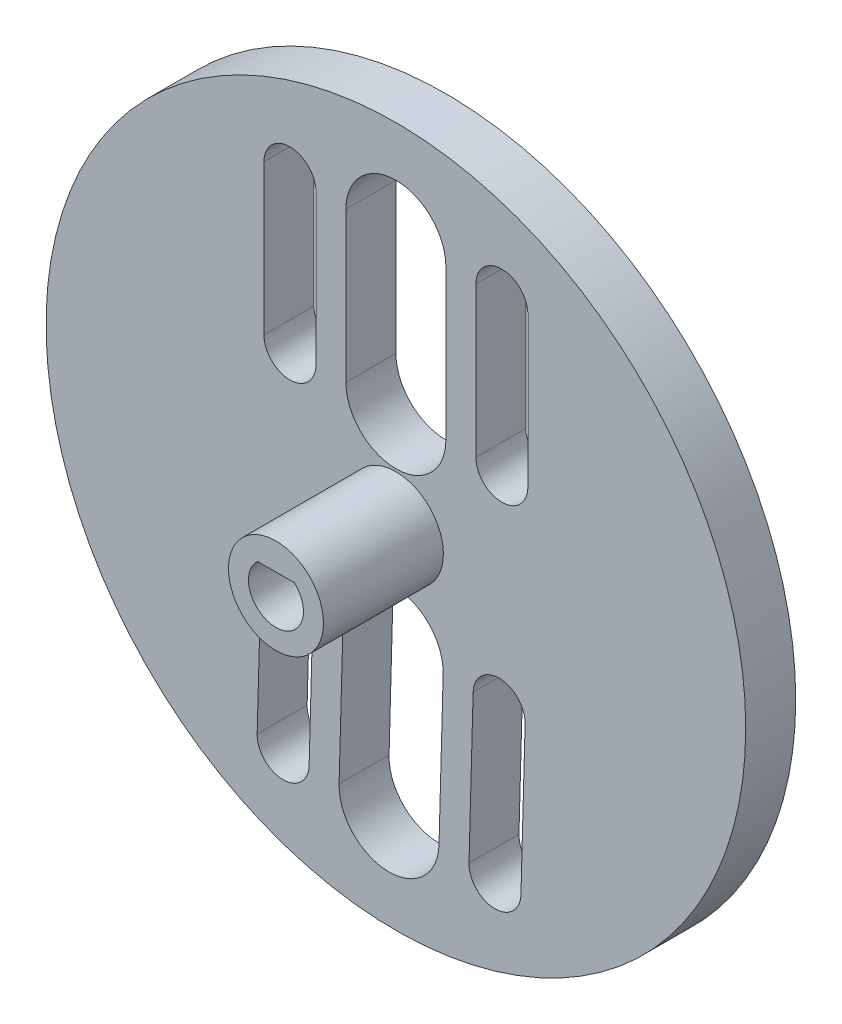
ISO-10303-21;
HEADER;
FILE_DESCRIPTION(('STEP AP214'),'2;1');
FILE_NAME('part.step','',(''),(''),'','','');
FILE_SCHEMA(('AUTOMOTIVE_DESIGN { 1 0 10303 214 1 1 1 1 }'));
ENDSEC;
DATA;
#1=APPLICATION_CONTEXT('core data for automotive mechanical design processes');
#2=APPLICATION_PROTOCOL_DEFINITION('international standard','automotive_design',2000,#1);
#3=PRODUCT_CONTEXT('',#1,'mechanical');
#4=PRODUCT('Part','Part','',(#3));
#5=PRODUCT_RELATED_PRODUCT_CATEGORY('part','',(#4));
#6=PRODUCT_DEFINITION_FORMATION('','',#4);
#7=PRODUCT_DEFINITION_CONTEXT('part definition',#1,'design');
#8=PRODUCT_DEFINITION('design','',#6,#7);
#9=PRODUCT_DEFINITION_SHAPE('','',#8);
#10=(LENGTH_UNIT() NAMED_UNIT(*) SI_UNIT(.MILLI.,.METRE.));
#11=(NAMED_UNIT(*) PLANE_ANGLE_UNIT() SI_UNIT($,.RADIAN.));
#12=(NAMED_UNIT(*) SI_UNIT($,.STERADIAN.) SOLID_ANGLE_UNIT());
#13=UNCERTAINTY_MEASURE_WITH_UNIT(LENGTH_MEASURE(1.E-05),#10,'distance_accuracy_value','');
#14=(GEOMETRIC_REPRESENTATION_CONTEXT(3) GLOBAL_UNCERTAINTY_ASSIGNED_CONTEXT((#13)) GLOBAL_UNIT_ASSIGNED_CONTEXT((#10,
#11,#12)) REPRESENTATION_CONTEXT('',''));
#15=CARTESIAN_POINT('',(0.,0.,0.));
#16=DIRECTION('',(0.,0.,1.));
#17=DIRECTION('',(1.,0.,0.));
#18=AXIS2_PLACEMENT_3D('',#15,#16,#17);
#19=CARTESIAN_POINT('',(0.,0.,5.));
#20=DIRECTION('',(0.,0.,1.));
#21=DIRECTION('',(1.,0.,0.));
#22=AXIS2_PLACEMENT_3D('',#19,#20,#21);
#23=PLANE('',#22);
#24=CARTESIAN_POINT('',(0.,0.,5.));
#25=DIRECTION('',(0.,0.,1.));
#26=DIRECTION('',(1.,0.,0.));
#27=AXIS2_PLACEMENT_3D('',#24,#25,#26);
#28=CIRCLE('',#27,4.75);
#29=CARTESIAN_POINT('',(4.75,0.,5.));
#30=VERTEX_POINT('',#29);
#31=EDGE_CURVE('E475',#30,#30,#28,.T.);
#32=ORIENTED_EDGE('',*,*,#31,.F.);
#33=EDGE_LOOP('',(#32));
#34=FACE_BOUND('',#33,.T.);
#35=CARTESIAN_POINT('',(-10.8678563010793,-9.99044167422661,5.));
#36=DIRECTION('',(0.,0.,1.));
#37=DIRECTION('',(1.,0.,0.));
#38=AXIS2_PLACEMENT_3D('',#35,#36,#37);
#39=CIRCLE('',#38,2.59999999999999);
#40=CARTESIAN_POINT('',(-8.2688454844185,-10.0621548172361,5.));
#41=VERTEX_POINT('',#40);
#42=CARTESIAN_POINT('',(-13.46686711774,-9.9187285312171,5.));
#43=VERTEX_POINT('',#42);
#44=EDGE_CURVE('E362',#41,#43,#39,.T.);
#45=ORIENTED_EDGE('',*,*,#44,.F.);
#46=DIRECTION('',(0.0275819780805787,0.999619544869528,0.));
#47=VECTOR('',#46,1.);
#48=CARTESIAN_POINT('',(-7.98512628759905,0.220329403687236,5.));
#49=LINE('',#48,#47);
#50=CARTESIAN_POINT('',(-8.68257515562718,-25.056447990279,5.));
#51=VERTEX_POINT('',#50);
#52=EDGE_CURVE('E287',#51,#41,#49,.T.);
#53=ORIENTED_EDGE('',*,*,#52,.F.);
#54=CARTESIAN_POINT('',(-11.2815859722879,-24.9847348472695,5.));
#55=DIRECTION('',(0.,0.,1.));
#56=DIRECTION('',(1.,0.,0.));
#57=AXIS2_PLACEMENT_3D('',#54,#55,#56);
#58=CIRCLE('',#57,2.59999999999999);
#59=CARTESIAN_POINT('',(-13.8805967889487,-24.91302170426,5.));
#60=VERTEX_POINT('',#59);
#61=EDGE_CURVE('E365',#60,#51,#58,.T.);
#62=ORIENTED_EDGE('',*,*,#61,.F.);
#63=DIRECTION('',(0.0275819780805777,0.999619544869528,0.));
#64=VECTOR('',#63,1.);
#65=CARTESIAN_POINT('',(-13.1831479209206,0.363755689706232,5.));
#66=LINE('',#65,#64);
#67=EDGE_CURVE('E371',#60,#43,#66,.T.);
#68=ORIENTED_EDGE('',*,*,#67,.T.);
#69=EDGE_LOOP('',(#45,#53,#62,#68));
#70=FACE_BOUND('',#69,.T.);
#71=CARTESIAN_POINT('',(-0.685618796670931,-25.2771038149237,5.));
#72=DIRECTION('',(0.,0.,1.));
#73=DIRECTION('',(1.,0.,0.));
#74=AXIS2_PLACEMENT_3D('',#71,#72,#73);
#75=CIRCLE('',#74,5.);
#76=CARTESIAN_POINT('',(-5.68371652101857,-25.1391939245208,5.));
#77=VERTEX_POINT('',#76);
#78=CARTESIAN_POINT('',(4.31247892767671,-25.4150137053265,5.));
#79=VERTEX_POINT('',#78);
#80=EDGE_CURVE('E373',#77,#79,#75,.T.);
#81=ORIENTED_EDGE('',*,*,#80,.F.);
#82=DIRECTION('',(-0.0275819780805781,-0.999619544869528,0.));
#83=VECTOR('',#82,1.);
#84=CARTESIAN_POINT('',(-4.98626765299046,0.137583469445497,5.));
#85=LINE('',#84,#83);
#86=CARTESIAN_POINT('',(-5.2699868498099,-10.1449007514778,5.));
#87=VERTEX_POINT('',#86);
#88=EDGE_CURVE('E376',#87,#77,#85,.T.);
#89=ORIENTED_EDGE('',*,*,#88,.F.);
#90=CARTESIAN_POINT('',(-0.27188912546226,-10.2828106418807,5.));
#91=DIRECTION('',(0.,0.,1.));
#92=DIRECTION('',(1.,0.,0.));
#93=AXIS2_PLACEMENT_3D('',#90,#91,#92);
#94=CIRCLE('',#93,5.);
#95=CARTESIAN_POINT('',(4.72620859888538,-10.4207205322836,5.));
#96=VERTEX_POINT('',#95);
#97=EDGE_CURVE('E379',#96,#87,#94,.T.);
#98=ORIENTED_EDGE('',*,*,#97,.F.);
#99=DIRECTION('',(-0.0275819780805781,-0.999619544869528,0.));
#100=VECTOR('',#99,1.);
#101=CARTESIAN_POINT('',(5.00992779570482,-0.138236311360284,5.));
#102=LINE('',#101,#100);
#103=EDGE_CURVE('E382',#96,#79,#102,.T.);
#104=ORIENTED_EDGE('',*,*,#103,.T.);
#105=EDGE_LOOP('',(#81,#89,#98,#104));
#106=FACE_BOUND('',#105,.T.);
#107=CARTESIAN_POINT('',(10.6,10.,5.));
#108=DIRECTION('',(0.,0.,1.));
#109=DIRECTION('',(1.,0.,0.));
#110=AXIS2_PLACEMENT_3D('',#107,#108,#109);
#111=CIRCLE('',#110,2.6);
#112=CARTESIAN_POINT('',(8.,10.,5.));
#113=VERTEX_POINT('',#112);
#114=CARTESIAN_POINT('',(13.2,10.,5.));
#115=VERTEX_POINT('',#114);
#116=EDGE_CURVE('E384',#113,#115,#111,.T.);
#117=ORIENTED_EDGE('',*,*,#116,.F.);
#118=DIRECTION('',(0.,-1.,0.));
#119=VECTOR('',#118,1.);
#120=CARTESIAN_POINT('',(8.00000000000001,0.,5.));
#121=LINE('',#120,#119);
#122=CARTESIAN_POINT('',(8.,25.,5.));
#123=VERTEX_POINT('',#122);
#124=EDGE_CURVE('E387',#123,#113,#121,.T.);
#125=ORIENTED_EDGE('',*,*,#124,.F.);
#126=CARTESIAN_POINT('',(10.6,25.,5.));
#127=DIRECTION('',(0.,0.,1.));
#128=DIRECTION('',(1.,0.,0.));
#129=AXIS2_PLACEMENT_3D('',#126,#127,#128);
#130=CIRCLE('',#129,2.6);
#131=CARTESIAN_POINT('',(13.2,25.,5.));
#132=VERTEX_POINT('',#131);
#133=EDGE_CURVE('E390',#132,#123,#130,.T.);
#134=ORIENTED_EDGE('',*,*,#133,.F.);
#135=DIRECTION('',(0.,-1.,0.));
#136=VECTOR('',#135,1.);
#137=CARTESIAN_POINT('',(13.2,0.,5.));
#138=LINE('',#137,#136);
#139=EDGE_CURVE('E393',#132,#115,#138,.T.);
#140=ORIENTED_EDGE('',*,*,#139,.T.);
#141=EDGE_LOOP('',(#117,#125,#134,#140));
#142=FACE_BOUND('',#141,.T.);
#143=CARTESIAN_POINT('',(0.,10.,5.));
#144=DIRECTION('',(0.,0.,1.));
#145=DIRECTION('',(1.,0.,0.));
#146=AXIS2_PLACEMENT_3D('',#143,#144,#145);
#147=CIRCLE('',#146,5.);
#148=CARTESIAN_POINT('',(-5.,10.,5.));
#149=VERTEX_POINT('',#148);
#150=CARTESIAN_POINT('',(5.,10.,5.));
#151=VERTEX_POINT('',#150);
#152=EDGE_CURVE('E395',#149,#151,#147,.T.);
#153=ORIENTED_EDGE('',*,*,#152,.F.);
#154=DIRECTION('',(0.,1.,0.));
#155=VECTOR('',#154,1.);
#156=CARTESIAN_POINT('',(-5.00000000000001,0.,5.));
#157=LINE('',#156,#155);
#158=CARTESIAN_POINT('',(-5.,25.,5.));
#159=VERTEX_POINT('',#158);
#160=EDGE_CURVE('E398',#149,#159,#157,.T.);
#161=ORIENTED_EDGE('',*,*,#160,.T.);
#162=CARTESIAN_POINT('',(0.,25.,5.));
#163=DIRECTION('',(0.,0.,1.));
#164=DIRECTION('',(1.,0.,0.));
#165=AXIS2_PLACEMENT_3D('',#162,#163,#164);
#166=CIRCLE('',#165,5.);
#167=CARTESIAN_POINT('',(5.,25.,5.));
#168=VERTEX_POINT('',#167);
#169=EDGE_CURVE('E400',#168,#159,#166,.T.);
#170=ORIENTED_EDGE('',*,*,#169,.F.);
#171=DIRECTION('',(0.,1.,0.));
#172=VECTOR('',#171,1.);
#173=CARTESIAN_POINT('',(5.,0.,5.));
#174=LINE('',#173,#172);
#175=EDGE_CURVE('E403',#151,#168,#174,.T.);
#176=ORIENTED_EDGE('',*,*,#175,.F.);
#177=EDGE_LOOP('',(#153,#161,#170,#176));
#178=FACE_BOUND('',#177,.T.);
#179=CARTESIAN_POINT('',(0.,0.,5.));
#180=DIRECTION('',(0.,0.,1.));
#181=DIRECTION('',(1.,0.,0.));
#182=AXIS2_PLACEMENT_3D('',#179,#180,#181);
#183=CIRCLE('',#182,35.);
#184=CARTESIAN_POINT('',(35.,0.,5.));
#185=VERTEX_POINT('',#184);
#186=EDGE_CURVE('E406',#185,#185,#183,.T.);
#187=ORIENTED_EDGE('',*,*,#186,.T.);
#188=EDGE_LOOP('',(#187));
#189=FACE_BOUND('',#188,.T.);
#190=DIRECTION('',(0.,-1.,0.));
#191=VECTOR('',#190,1.);
#192=CARTESIAN_POINT('',(-8.00000000000001,0.,5.));
#193=LINE('',#192,#191);
#194=CARTESIAN_POINT('',(-8.,25.,5.));
#195=VERTEX_POINT('',#194);
#196=CARTESIAN_POINT('',(-8.,10.,5.));
#197=VERTEX_POINT('',#196);
#198=EDGE_CURVE('E409',#195,#197,#193,.T.);
#199=ORIENTED_EDGE('',*,*,#198,.T.);
#200=CARTESIAN_POINT('',(-10.6,10.,5.));
#201=DIRECTION('',(0.,0.,1.));
#202=DIRECTION('',(1.,0.,0.));
#203=AXIS2_PLACEMENT_3D('',#200,#201,#202);
#204=CIRCLE('',#203,2.6);
#205=CARTESIAN_POINT('',(-13.2,10.,5.));
#206=VERTEX_POINT('',#205);
#207=EDGE_CURVE('E412',#197,#206,#204,.F.);
#208=ORIENTED_EDGE('',*,*,#207,.T.);
#209=DIRECTION('',(0.,-1.,0.));
#210=VECTOR('',#209,1.);
#211=CARTESIAN_POINT('',(-13.2,0.,5.));
#212=LINE('',#211,#210);
#213=CARTESIAN_POINT('',(-13.2,25.,5.));
#214=VERTEX_POINT('',#213);
#215=EDGE_CURVE('E414',#214,#206,#212,.T.);
#216=ORIENTED_EDGE('',*,*,#215,.F.);
#217=CARTESIAN_POINT('',(-10.6,25.,5.));
#218=DIRECTION('',(0.,0.,1.));
#219=DIRECTION('',(1.,0.,0.));
#220=AXIS2_PLACEMENT_3D('',#217,#218,#219);
#221=CIRCLE('',#220,2.6);
#222=EDGE_CURVE('E417',#214,#195,#221,.F.);
#223=ORIENTED_EDGE('',*,*,#222,.T.);
#224=EDGE_LOOP('',(#199,#208,#216,#223));
#225=FACE_BOUND('',#224,.T.);
#226=DIRECTION('',(0.0275819780805779,0.999619544869528,0.));
#227=VECTOR('',#226,1.);
#228=CARTESIAN_POINT('',(13.2068080636349,-0.364408531621021,5.));
#229=LINE('',#228,#227);
#230=CARTESIAN_POINT('',(12.5093591956068,-25.6411859255873,5.));
#231=VERTEX_POINT('',#230);
#232=CARTESIAN_POINT('',(12.9230888668155,-10.6468927525444,5.));
#233=VERTEX_POINT('',#232);
#234=EDGE_CURVE('E228',#231,#233,#229,.T.);
#235=ORIENTED_EDGE('',*,*,#234,.F.);
#236=CARTESIAN_POINT('',(9.91034837894607,-25.5694727825778,5.));
#237=DIRECTION('',(0.,0.,1.));
#238=DIRECTION('',(1.,0.,0.));
#239=AXIS2_PLACEMENT_3D('',#236,#237,#238);
#240=CIRCLE('',#239,2.6);
#241=CARTESIAN_POINT('',(7.31133756228529,-25.4977596395683,5.));
#242=VERTEX_POINT('',#241);
#243=EDGE_CURVE('E225',#231,#242,#240,.F.);
#244=ORIENTED_EDGE('',*,*,#243,.T.);
#245=DIRECTION('',(0.0275819780805782,0.999619544869528,0.));
#246=VECTOR('',#245,1.);
#247=CARTESIAN_POINT('',(8.00878643031341,-0.220982245602019,5.));
#248=LINE('',#247,#246);
#249=CARTESIAN_POINT('',(7.72506723349397,-10.5034664665254,5.));
#250=VERTEX_POINT('',#249);
#251=EDGE_CURVE('E217',#242,#250,#248,.T.);
#252=ORIENTED_EDGE('',*,*,#251,.T.);
#253=CARTESIAN_POINT('',(10.3240780501547,-10.5751796095349,5.));
#254=DIRECTION('',(0.,0.,1.));
#255=DIRECTION('',(1.,0.,0.));
#256=AXIS2_PLACEMENT_3D('',#253,#254,#255);
#257=CIRCLE('',#256,2.6);
#258=EDGE_CURVE('E63',#250,#233,#257,.F.);
#259=ORIENTED_EDGE('',*,*,#258,.T.);
#260=EDGE_LOOP('',(#235,#244,#252,#259));
#261=FACE_BOUND('',#260,.T.);
#262=ADVANCED_FACE('F37',(#34,#70,#106,#142,#178,#189,#225,#261),#23,.T.);
#263=CARTESIAN_POINT('',(0.,0.,0.));
#264=DIRECTION('',(0.,0.,1.));
#265=DIRECTION('',(1.,0.,0.));
#266=AXIS2_PLACEMENT_3D('',#263,#264,#265);
#267=PLANE('',#266);
#268=DIRECTION('',(0.0275819780805779,0.999619544869528,0.));
#269=VECTOR('',#268,1.);
#270=CARTESIAN_POINT('',(13.2068080636349,-0.364408531621021,0.));
#271=LINE('',#270,#269);
#272=CARTESIAN_POINT('',(12.5093591956068,-25.6411859255873,0.));
#273=VERTEX_POINT('',#272);
#274=CARTESIAN_POINT('',(12.9230888668155,-10.6468927525444,0.));
#275=VERTEX_POINT('',#274);
#276=EDGE_CURVE('E355',#273,#275,#271,.T.);
#277=ORIENTED_EDGE('',*,*,#276,.T.);
#278=CARTESIAN_POINT('',(10.3240780501547,-10.5751796095349,0.));
#279=DIRECTION('',(0.,0.,1.));
#280=DIRECTION('',(1.,0.,0.));
#281=AXIS2_PLACEMENT_3D('',#278,#279,#280);
#282=CIRCLE('',#281,2.6);
#283=CARTESIAN_POINT('',(7.72506723349397,-10.5034664665254,0.));
#284=VERTEX_POINT('',#283);
#285=EDGE_CURVE('E361',#284,#275,#282,.F.);
#286=ORIENTED_EDGE('',*,*,#285,.F.);
#287=DIRECTION('',(0.0275819780805782,0.999619544869528,0.));
#288=VECTOR('',#287,1.);
#289=CARTESIAN_POINT('',(8.00878643031341,-0.220982245602019,0.));
#290=LINE('',#289,#288);
#291=CARTESIAN_POINT('',(7.31133756228529,-25.4977596395683,0.));
#292=VERTEX_POINT('',#291);
#293=EDGE_CURVE('E359',#292,#284,#290,.T.);
#294=ORIENTED_EDGE('',*,*,#293,.F.);
#295=CARTESIAN_POINT('',(9.91034837894607,-25.5694727825778,0.));
#296=DIRECTION('',(0.,0.,1.));
#297=DIRECTION('',(1.,0.,0.));
#298=AXIS2_PLACEMENT_3D('',#295,#296,#297);
#299=CIRCLE('',#298,2.6);
#300=EDGE_CURVE('E233',#273,#292,#299,.F.);
#301=ORIENTED_EDGE('',*,*,#300,.F.);
#302=EDGE_LOOP('',(#277,#286,#294,#301));
#303=FACE_BOUND('',#302,.T.);
#304=DIRECTION('',(0.,-1.,0.));
#305=VECTOR('',#304,1.);
#306=CARTESIAN_POINT('',(-8.00000000000001,0.,0.));
#307=LINE('',#306,#305);
#308=CARTESIAN_POINT('',(-8.,25.,0.));
#309=VERTEX_POINT('',#308);
#310=CARTESIAN_POINT('',(-8.,10.,0.));
#311=VERTEX_POINT('',#310);
#312=EDGE_CURVE('E344',#309,#311,#307,.T.);
#313=ORIENTED_EDGE('',*,*,#312,.F.);
#314=CARTESIAN_POINT('',(-10.6,25.,0.));
#315=DIRECTION('',(0.,0.,1.));
#316=DIRECTION('',(1.,0.,0.));
#317=AXIS2_PLACEMENT_3D('',#314,#315,#316);
#318=CIRCLE('',#317,2.6);
#319=CARTESIAN_POINT('',(-13.2,25.,0.));
#320=VERTEX_POINT('',#319);
#321=EDGE_CURVE('E353',#320,#309,#318,.F.);
#322=ORIENTED_EDGE('',*,*,#321,.F.);
#323=DIRECTION('',(0.,-1.,0.));
#324=VECTOR('',#323,1.);
#325=CARTESIAN_POINT('',(-13.2,0.,0.));
#326=LINE('',#325,#324);
#327=CARTESIAN_POINT('',(-13.2,10.,0.));
#328=VERTEX_POINT('',#327);
#329=EDGE_CURVE('E350',#320,#328,#326,.T.);
#330=ORIENTED_EDGE('',*,*,#329,.T.);
#331=CARTESIAN_POINT('',(-10.6,10.,0.));
#332=DIRECTION('',(0.,0.,1.));
#333=DIRECTION('',(1.,0.,0.));
#334=AXIS2_PLACEMENT_3D('',#331,#332,#333);
#335=CIRCLE('',#334,2.6);
#336=EDGE_CURVE('E347',#311,#328,#335,.F.);
#337=ORIENTED_EDGE('',*,*,#336,.F.);
#338=EDGE_LOOP('',(#313,#322,#330,#337));
#339=FACE_BOUND('',#338,.T.);
#340=CARTESIAN_POINT('',(0.,0.,0.));
#341=DIRECTION('',(0.,0.,1.));
#342=DIRECTION('',(1.,0.,0.));
#343=AXIS2_PLACEMENT_3D('',#340,#341,#342);
#344=CIRCLE('',#343,35.);
#345=CARTESIAN_POINT('',(35.,0.,0.));
#346=VERTEX_POINT('',#345);
#347=EDGE_CURVE('E341',#346,#346,#344,.T.);
#348=ORIENTED_EDGE('',*,*,#347,.F.);
#349=EDGE_LOOP('',(#348));
#350=FACE_BOUND('',#349,.T.);
#351=CARTESIAN_POINT('',(0.,10.,0.));
#352=DIRECTION('',(0.,0.,1.));
#353=DIRECTION('',(1.,0.,0.));
#354=AXIS2_PLACEMENT_3D('',#351,#352,#353);
#355=CIRCLE('',#354,5.);
#356=CARTESIAN_POINT('',(-5.,10.,0.));
#357=VERTEX_POINT('',#356);
#358=CARTESIAN_POINT('',(5.,10.,0.));
#359=VERTEX_POINT('',#358);
#360=EDGE_CURVE('E329',#357,#359,#355,.T.);
#361=ORIENTED_EDGE('',*,*,#360,.T.);
#362=DIRECTION('',(0.,1.,0.));
#363=VECTOR('',#362,1.);
#364=CARTESIAN_POINT('',(5.,0.,0.));
#365=LINE('',#364,#363);
#366=CARTESIAN_POINT('',(5.,25.,0.));
#367=VERTEX_POINT('',#366);
#368=EDGE_CURVE('E338',#359,#367,#365,.T.);
#369=ORIENTED_EDGE('',*,*,#368,.T.);
#370=CARTESIAN_POINT('',(0.,25.,0.));
#371=DIRECTION('',(0.,0.,1.));
#372=DIRECTION('',(1.,0.,0.));
#373=AXIS2_PLACEMENT_3D('',#370,#371,#372);
#374=CIRCLE('',#373,5.);
#375=CARTESIAN_POINT('',(-5.,25.,0.));
#376=VERTEX_POINT('',#375);
#377=EDGE_CURVE('E335',#367,#376,#374,.T.);
#378=ORIENTED_EDGE('',*,*,#377,.T.);
#379=DIRECTION('',(0.,1.,0.));
#380=VECTOR('',#379,1.);
#381=CARTESIAN_POINT('',(-5.00000000000001,0.,0.));
#382=LINE('',#381,#380);
#383=EDGE_CURVE('E332',#357,#376,#382,.T.);
#384=ORIENTED_EDGE('',*,*,#383,.F.);
#385=EDGE_LOOP('',(#361,#369,#378,#384));
#386=FACE_BOUND('',#385,.T.);
#387=CARTESIAN_POINT('',(10.6,10.,0.));
#388=DIRECTION('',(0.,0.,1.));
#389=DIRECTION('',(1.,0.,0.));
#390=AXIS2_PLACEMENT_3D('',#387,#388,#389);
#391=CIRCLE('',#390,2.6);
#392=CARTESIAN_POINT('',(8.,10.,0.));
#393=VERTEX_POINT('',#392);
#394=CARTESIAN_POINT('',(13.2,10.,0.));
#395=VERTEX_POINT('',#394);
#396=EDGE_CURVE('E317',#393,#395,#391,.T.);
#397=ORIENTED_EDGE('',*,*,#396,.T.);
#398=DIRECTION('',(0.,-1.,0.));
#399=VECTOR('',#398,1.);
#400=CARTESIAN_POINT('',(13.2,0.,0.));
#401=LINE('',#400,#399);
#402=CARTESIAN_POINT('',(13.2,25.,0.));
#403=VERTEX_POINT('',#402);
#404=EDGE_CURVE('E326',#403,#395,#401,.T.);
#405=ORIENTED_EDGE('',*,*,#404,.F.);
#406=CARTESIAN_POINT('',(10.6,25.,0.));
#407=DIRECTION('',(0.,0.,1.));
#408=DIRECTION('',(1.,0.,0.));
#409=AXIS2_PLACEMENT_3D('',#406,#407,#408);
#410=CIRCLE('',#409,2.6);
#411=CARTESIAN_POINT('',(8.,25.,0.));
#412=VERTEX_POINT('',#411);
#413=EDGE_CURVE('E323',#403,#412,#410,.T.);
#414=ORIENTED_EDGE('',*,*,#413,.T.);
#415=DIRECTION('',(0.,-1.,0.));
#416=VECTOR('',#415,1.);
#417=CARTESIAN_POINT('',(8.00000000000001,0.,0.));
#418=LINE('',#417,#416);
#419=EDGE_CURVE('E320',#412,#393,#418,.T.);
#420=ORIENTED_EDGE('',*,*,#419,.T.);
#421=EDGE_LOOP('',(#397,#405,#414,#420));
#422=FACE_BOUND('',#421,.T.);
#423=CARTESIAN_POINT('',(-0.685618796670931,-25.2771038149237,0.));
#424=DIRECTION('',(0.,0.,1.));
#425=DIRECTION('',(1.,0.,0.));
#426=AXIS2_PLACEMENT_3D('',#423,#424,#425);
#427=CIRCLE('',#426,5.);
#428=CARTESIAN_POINT('',(-5.68371652101857,-25.1391939245208,0.));
#429=VERTEX_POINT('',#428);
#430=CARTESIAN_POINT('',(4.31247892767671,-25.4150137053265,0.));
#431=VERTEX_POINT('',#430);
#432=EDGE_CURVE('E305',#429,#431,#427,.T.);
#433=ORIENTED_EDGE('',*,*,#432,.T.);
#434=DIRECTION('',(-0.0275819780805781,-0.999619544869528,0.));
#435=VECTOR('',#434,1.);
#436=CARTESIAN_POINT('',(5.00992779570482,-0.138236311360284,0.));
#437=LINE('',#436,#435);
#438=CARTESIAN_POINT('',(4.72620859888538,-10.4207205322836,0.));
#439=VERTEX_POINT('',#438);
#440=EDGE_CURVE('E314',#439,#431,#437,.T.);
#441=ORIENTED_EDGE('',*,*,#440,.F.);
#442=CARTESIAN_POINT('',(-0.27188912546226,-10.2828106418807,0.));
#443=DIRECTION('',(0.,0.,1.));
#444=DIRECTION('',(1.,0.,0.));
#445=AXIS2_PLACEMENT_3D('',#442,#443,#444);
#446=CIRCLE('',#445,5.);
#447=CARTESIAN_POINT('',(-5.2699868498099,-10.1449007514778,0.));
#448=VERTEX_POINT('',#447);
#449=EDGE_CURVE('E311',#439,#448,#446,.T.);
#450=ORIENTED_EDGE('',*,*,#449,.T.);
#451=DIRECTION('',(-0.0275819780805781,-0.999619544869528,0.));
#452=VECTOR('',#451,1.);
#453=CARTESIAN_POINT('',(-4.98626765299046,0.137583469445497,0.));
#454=LINE('',#453,#452);
#455=EDGE_CURVE('E308',#448,#429,#454,.T.);
#456=ORIENTED_EDGE('',*,*,#455,.T.);
#457=EDGE_LOOP('',(#433,#441,#450,#456));
#458=FACE_BOUND('',#457,.T.);
#459=CARTESIAN_POINT('',(-10.8678563010793,-9.99044167422661,0.));
#460=DIRECTION('',(0.,0.,1.));
#461=DIRECTION('',(1.,0.,0.));
#462=AXIS2_PLACEMENT_3D('',#459,#460,#461);
#463=CIRCLE('',#462,2.59999999999999);
#464=CARTESIAN_POINT('',(-8.2688454844185,-10.0621548172361,0.));
#465=VERTEX_POINT('',#464);
#466=CARTESIAN_POINT('',(-13.46686711774,-9.9187285312171,0.));
#467=VERTEX_POINT('',#466);
#468=EDGE_CURVE('E289',#465,#467,#463,.T.);
#469=ORIENTED_EDGE('',*,*,#468,.T.);
#470=DIRECTION('',(0.0275819780805777,0.999619544869528,0.));
#471=VECTOR('',#470,1.);
#472=CARTESIAN_POINT('',(-13.1831479209206,0.363755689706232,0.));
#473=LINE('',#472,#471);
#474=CARTESIAN_POINT('',(-13.8805967889487,-24.91302170426,0.));
#475=VERTEX_POINT('',#474);
#476=EDGE_CURVE('E300',#475,#467,#473,.T.);
#477=ORIENTED_EDGE('',*,*,#476,.F.);
#478=CARTESIAN_POINT('',(-11.2815859722879,-24.9847348472695,0.));
#479=DIRECTION('',(0.,0.,1.));
#480=DIRECTION('',(1.,0.,0.));
#481=AXIS2_PLACEMENT_3D('',#478,#479,#480);
#482=CIRCLE('',#481,2.59999999999999);
#483=CARTESIAN_POINT('',(-8.68257515562718,-25.056447990279,0.));
#484=VERTEX_POINT('',#483);
#485=EDGE_CURVE('E298',#475,#484,#482,.T.);
#486=ORIENTED_EDGE('',*,*,#485,.T.);
#487=DIRECTION('',(0.0275819780805787,0.999619544869528,0.));
#488=VECTOR('',#487,1.);
#489=CARTESIAN_POINT('',(-7.98512628759905,0.220329403687236,0.));
#490=LINE('',#489,#488);
#491=EDGE_CURVE('E284',#484,#465,#490,.T.);
#492=ORIENTED_EDGE('',*,*,#491,.T.);
#493=EDGE_LOOP('',(#469,#477,#486,#492));
#494=FACE_BOUND('',#493,.T.);
#495=DIRECTION('',(-1.,0.,0.));
#496=VECTOR('',#495,1.);
#497=CARTESIAN_POINT('',(0.,2.05,0.));
#498=LINE('',#497,#496);
#499=CARTESIAN_POINT('',(1.83303027798234,2.05,0.));
#500=VERTEX_POINT('',#499);
#501=CARTESIAN_POINT('',(-1.83303027798234,2.05,0.));
#502=VERTEX_POINT('',#501);
#503=EDGE_CURVE('E54',#500,#502,#498,.T.);
#504=ORIENTED_EDGE('',*,*,#503,.T.);
#505=CARTESIAN_POINT('',(0.,0.,0.));
#506=DIRECTION('',(0.,0.,1.));
#507=DIRECTION('',(1.,0.,0.));
#508=AXIS2_PLACEMENT_3D('',#505,#506,#507);
#509=CIRCLE('',#508,2.75);
#510=EDGE_CURVE('E294',#500,#502,#509,.F.);
#511=ORIENTED_EDGE('',*,*,#510,.F.);
#512=EDGE_LOOP('',(#504,#511));
#513=FACE_BOUND('',#512,.T.);
#514=ADVANCED_FACE('F296',(#303,#339,#350,#386,#422,#458,#494,#513),#267,.F.);
#515=CARTESIAN_POINT('',(13.2068080636349,-0.364408531621021,5.));
#516=DIRECTION('',(-0.999619544869528,0.0275819780805779,0.));
#517=DIRECTION('',(-0.0275819780805779,-0.999619544869528,0.));
#518=AXIS2_PLACEMENT_3D('',#515,#516,#517);
#519=PLANE('',#518);
#520=ORIENTED_EDGE('',*,*,#276,.F.);
#521=DIRECTION('',(0.,0.,-1.));
#522=VECTOR('',#521,1.);
#523=CARTESIAN_POINT('',(12.5093591956068,-25.6411859255873,5.));
#524=LINE('',#523,#522);
#525=EDGE_CURVE('E11',#231,#273,#524,.T.);
#526=ORIENTED_EDGE('',*,*,#525,.F.);
#527=ORIENTED_EDGE('',*,*,#234,.T.);
#528=DIRECTION('',(0.,0.,-1.));
#529=VECTOR('',#528,1.);
#530=CARTESIAN_POINT('',(12.9230888668155,-10.6468927525444,5.));
#531=LINE('',#530,#529);
#532=EDGE_CURVE('E143',#233,#275,#531,.T.);
#533=ORIENTED_EDGE('',*,*,#532,.T.);
#534=EDGE_LOOP('',(#520,#526,#527,#533));
#535=FACE_BOUND('',#534,.T.);
#536=ADVANCED_FACE('F419',(#535),#519,.T.);
#537=CARTESIAN_POINT('',(9.91034837894607,-25.5694727825778,5.));
#538=DIRECTION('',(0.,0.,-1.));
#539=DIRECTION('',(-1.,0.,0.));
#540=AXIS2_PLACEMENT_3D('',#537,#538,#539);
#541=CYLINDRICAL_SURFACE('',#540,2.6);
#542=ORIENTED_EDGE('',*,*,#300,.T.);
#543=DIRECTION('',(0.,0.,-1.));
#544=VECTOR('',#543,1.);
#545=CARTESIAN_POINT('',(7.31133756228529,-25.4977596395683,5.));
#546=LINE('',#545,#544);
#547=EDGE_CURVE('E46',#242,#292,#546,.T.);
#548=ORIENTED_EDGE('',*,*,#547,.F.);
#549=ORIENTED_EDGE('',*,*,#243,.F.);
#550=ORIENTED_EDGE('',*,*,#525,.T.);
#551=EDGE_LOOP('',(#542,#548,#549,#550));
#552=FACE_BOUND('',#551,.T.);
#553=ADVANCED_FACE('F231',(#552),#541,.F.);
#554=CARTESIAN_POINT('',(8.00878643031341,-0.220982245602019,5.));
#555=DIRECTION('',(-0.999619544869528,0.0275819780805782,0.));
#556=DIRECTION('',(-0.0275819780805782,-0.999619544869528,0.));
#557=AXIS2_PLACEMENT_3D('',#554,#555,#556);
#558=PLANE('',#557);
#559=ORIENTED_EDGE('',*,*,#293,.T.);
#560=DIRECTION('',(0.,0.,-1.));
#561=VECTOR('',#560,1.);
#562=CARTESIAN_POINT('',(7.72506723349397,-10.5034664665254,5.));
#563=LINE('',#562,#561);
#564=EDGE_CURVE('E224',#250,#284,#563,.T.);
#565=ORIENTED_EDGE('',*,*,#564,.F.);
#566=ORIENTED_EDGE('',*,*,#251,.F.);
#567=ORIENTED_EDGE('',*,*,#547,.T.);
#568=EDGE_LOOP('',(#559,#565,#566,#567));
#569=FACE_BOUND('',#568,.T.);
#570=ADVANCED_FACE('F220',(#569),#558,.F.);
#571=CARTESIAN_POINT('',(-8.00000000000001,0.,5.));
#572=DIRECTION('',(1.,0.,0.));
#573=DIRECTION('',(0.,1.,0.));
#574=AXIS2_PLACEMENT_3D('',#571,#572,#573);
#575=PLANE('',#574);
#576=ORIENTED_EDGE('',*,*,#312,.T.);
#577=DIRECTION('',(0.,0.,-1.));
#578=VECTOR('',#577,1.);
#579=CARTESIAN_POINT('',(-8.,10.,5.));
#580=LINE('',#579,#578);
#581=EDGE_CURVE('E246',#197,#311,#580,.T.);
#582=ORIENTED_EDGE('',*,*,#581,.F.);
#583=ORIENTED_EDGE('',*,*,#198,.F.);
#584=DIRECTION('',(0.,0.,-1.));
#585=VECTOR('',#584,1.);
#586=CARTESIAN_POINT('',(-8.,25.,5.));
#587=LINE('',#586,#585);
#588=EDGE_CURVE('E238',#195,#309,#587,.T.);
#589=ORIENTED_EDGE('',*,*,#588,.T.);
#590=EDGE_LOOP('',(#576,#582,#583,#589));
#591=FACE_BOUND('',#590,.T.);
#592=ADVANCED_FACE('F703',(#591),#575,.F.);
#593=CARTESIAN_POINT('',(-10.6,10.,5.));
#594=DIRECTION('',(0.,0.,-1.));
#595=DIRECTION('',(-1.,0.,0.));
#596=AXIS2_PLACEMENT_3D('',#593,#594,#595);
#597=CYLINDRICAL_SURFACE('',#596,2.6);
#598=ORIENTED_EDGE('',*,*,#336,.T.);
#599=DIRECTION('',(0.,0.,-1.));
#600=VECTOR('',#599,1.);
#601=CARTESIAN_POINT('',(-13.2,10.,5.));
#602=LINE('',#601,#600);
#603=EDGE_CURVE('E244',#206,#328,#602,.T.);
#604=ORIENTED_EDGE('',*,*,#603,.F.);
#605=ORIENTED_EDGE('',*,*,#207,.F.);
#606=ORIENTED_EDGE('',*,*,#581,.T.);
#607=EDGE_LOOP('',(#598,#604,#605,#606));
#608=FACE_BOUND('',#607,.T.);
#609=ADVANCED_FACE('F693',(#608),#597,.F.);
#610=CARTESIAN_POINT('',(-13.2,0.,5.));
#611=DIRECTION('',(1.,0.,0.));
#612=DIRECTION('',(0.,1.,0.));
#613=AXIS2_PLACEMENT_3D('',#610,#611,#612);
#614=PLANE('',#613);
#615=ORIENTED_EDGE('',*,*,#329,.F.);
#616=DIRECTION('',(0.,0.,-1.));
#617=VECTOR('',#616,1.);
#618=CARTESIAN_POINT('',(-13.2,25.,5.));
#619=LINE('',#618,#617);
#620=EDGE_CURVE('E241',#214,#320,#619,.T.);
#621=ORIENTED_EDGE('',*,*,#620,.F.);
#622=ORIENTED_EDGE('',*,*,#215,.T.);
#623=ORIENTED_EDGE('',*,*,#603,.T.);
#624=EDGE_LOOP('',(#615,#621,#622,#623));
#625=FACE_BOUND('',#624,.T.);
#626=ADVANCED_FACE('F683',(#625),#614,.T.);
#627=CARTESIAN_POINT('',(0.,10.,5.));
#628=DIRECTION('',(0.,0.,-1.));
#629=DIRECTION('',(-1.,0.,0.));
#630=AXIS2_PLACEMENT_3D('',#627,#628,#629);
#631=CYLINDRICAL_SURFACE('',#630,5.);
#632=ORIENTED_EDGE('',*,*,#360,.F.);
#633=DIRECTION('',(0.,0.,-1.));
#634=VECTOR('',#633,1.);
#635=CARTESIAN_POINT('',(-5.,10.,5.));
#636=LINE('',#635,#634);
#637=EDGE_CURVE('E242',#149,#357,#636,.T.);
#638=ORIENTED_EDGE('',*,*,#637,.F.);
#639=ORIENTED_EDGE('',*,*,#152,.T.);
#640=DIRECTION('',(0.,0.,-1.));
#641=VECTOR('',#640,1.);
#642=CARTESIAN_POINT('',(5.,10.,5.));
#643=LINE('',#642,#641);
#644=EDGE_CURVE('E249',#151,#359,#643,.T.);
#645=ORIENTED_EDGE('',*,*,#644,.T.);
#646=EDGE_LOOP('',(#632,#638,#639,#645));
#647=FACE_BOUND('',#646,.T.);
#648=ADVANCED_FACE('F673',(#647),#631,.F.);
#649=CARTESIAN_POINT('',(-5.00000000000001,0.,5.));
#650=DIRECTION('',(-1.,0.,0.));
#651=DIRECTION('',(0.,-1.,0.));
#652=AXIS2_PLACEMENT_3D('',#649,#650,#651);
#653=PLANE('',#652);
#654=ORIENTED_EDGE('',*,*,#383,.T.);
#655=DIRECTION('',(0.,0.,-1.));
#656=VECTOR('',#655,1.);
#657=CARTESIAN_POINT('',(-5.,25.,5.));
#658=LINE('',#657,#656);
#659=EDGE_CURVE('E254',#159,#376,#658,.T.);
#660=ORIENTED_EDGE('',*,*,#659,.F.);
#661=ORIENTED_EDGE('',*,*,#160,.F.);
#662=ORIENTED_EDGE('',*,*,#637,.T.);
#663=EDGE_LOOP('',(#654,#660,#661,#662));
#664=FACE_BOUND('',#663,.T.);
#665=ADVANCED_FACE('F663',(#664),#653,.F.);
#666=CARTESIAN_POINT('',(0.,25.,5.));
#667=DIRECTION('',(0.,0.,-1.));
#668=DIRECTION('',(-1.,0.,0.));
#669=AXIS2_PLACEMENT_3D('',#666,#667,#668);
#670=CYLINDRICAL_SURFACE('',#669,5.);
#671=ORIENTED_EDGE('',*,*,#377,.F.);
#672=DIRECTION('',(0.,0.,-1.));
#673=VECTOR('',#672,1.);
#674=CARTESIAN_POINT('',(5.,25.,5.));
#675=LINE('',#674,#673);
#676=EDGE_CURVE('E251',#168,#367,#675,.T.);
#677=ORIENTED_EDGE('',*,*,#676,.F.);
#678=ORIENTED_EDGE('',*,*,#169,.T.);
#679=ORIENTED_EDGE('',*,*,#659,.T.);
#680=EDGE_LOOP('',(#671,#677,#678,#679));
#681=FACE_BOUND('',#680,.T.);
#682=ADVANCED_FACE('F653',(#681),#670,.F.);
#683=CARTESIAN_POINT('',(10.6,10.,5.));
#684=DIRECTION('',(0.,0.,-1.));
#685=DIRECTION('',(-1.,0.,0.));
#686=AXIS2_PLACEMENT_3D('',#683,#684,#685);
#687=CYLINDRICAL_SURFACE('',#686,2.6);
#688=ORIENTED_EDGE('',*,*,#396,.F.);
#689=DIRECTION('',(0.,0.,-1.));
#690=VECTOR('',#689,1.);
#691=CARTESIAN_POINT('',(8.,10.,5.));
#692=LINE('',#691,#690);
#693=EDGE_CURVE('E252',#113,#393,#692,.T.);
#694=ORIENTED_EDGE('',*,*,#693,.F.);
#695=ORIENTED_EDGE('',*,*,#116,.T.);
#696=DIRECTION('',(0.,0.,-1.));
#697=VECTOR('',#696,1.);
#698=CARTESIAN_POINT('',(13.2,10.,5.));
#699=LINE('',#698,#697);
#700=EDGE_CURVE('E257',#115,#395,#699,.T.);
#701=ORIENTED_EDGE('',*,*,#700,.T.);
#702=EDGE_LOOP('',(#688,#694,#695,#701));
#703=FACE_BOUND('',#702,.T.);
#704=ADVANCED_FACE('F643',(#703),#687,.F.);
#705=CARTESIAN_POINT('',(8.00000000000001,0.,5.));
#706=DIRECTION('',(1.,0.,0.));
#707=DIRECTION('',(0.,1.,0.));
#708=AXIS2_PLACEMENT_3D('',#705,#706,#707);
#709=PLANE('',#708);
#710=ORIENTED_EDGE('',*,*,#419,.F.);
#711=DIRECTION('',(0.,0.,-1.));
#712=VECTOR('',#711,1.);
#713=CARTESIAN_POINT('',(8.,25.,5.));
#714=LINE('',#713,#712);
#715=EDGE_CURVE('E262',#123,#412,#714,.T.);
#716=ORIENTED_EDGE('',*,*,#715,.F.);
#717=ORIENTED_EDGE('',*,*,#124,.T.);
#718=ORIENTED_EDGE('',*,*,#693,.T.);
#719=EDGE_LOOP('',(#710,#716,#717,#718));
#720=FACE_BOUND('',#719,.T.);
#721=ADVANCED_FACE('F633',(#720),#709,.T.);
#722=CARTESIAN_POINT('',(10.6,25.,5.));
#723=DIRECTION('',(0.,0.,-1.));
#724=DIRECTION('',(-1.,0.,0.));
#725=AXIS2_PLACEMENT_3D('',#722,#723,#724);
#726=CYLINDRICAL_SURFACE('',#725,2.6);
#727=ORIENTED_EDGE('',*,*,#413,.F.);
#728=DIRECTION('',(0.,0.,-1.));
#729=VECTOR('',#728,1.);
#730=CARTESIAN_POINT('',(13.2,25.,5.));
#731=LINE('',#730,#729);
#732=EDGE_CURVE('E259',#132,#403,#731,.T.);
#733=ORIENTED_EDGE('',*,*,#732,.F.);
#734=ORIENTED_EDGE('',*,*,#133,.T.);
#735=ORIENTED_EDGE('',*,*,#715,.T.);
#736=EDGE_LOOP('',(#727,#733,#734,#735));
#737=FACE_BOUND('',#736,.T.);
#738=ADVANCED_FACE('F623',(#737),#726,.F.);
#739=CARTESIAN_POINT('',(-0.685618796670931,-25.2771038149237,5.));
#740=DIRECTION('',(0.,0.,-1.));
#741=DIRECTION('',(-1.,0.,0.));
#742=AXIS2_PLACEMENT_3D('',#739,#740,#741);
#743=CYLINDRICAL_SURFACE('',#742,5.);
#744=ORIENTED_EDGE('',*,*,#432,.F.);
#745=DIRECTION('',(0.,0.,-1.));
#746=VECTOR('',#745,1.);
#747=CARTESIAN_POINT('',(-5.68371652101857,-25.1391939245208,5.));
#748=LINE('',#747,#746);
#749=EDGE_CURVE('E260',#77,#429,#748,.T.);
#750=ORIENTED_EDGE('',*,*,#749,.F.);
#751=ORIENTED_EDGE('',*,*,#80,.T.);
#752=DIRECTION('',(0.,0.,-1.));
#753=VECTOR('',#752,1.);
#754=CARTESIAN_POINT('',(4.31247892767671,-25.4150137053265,5.));
#755=LINE('',#754,#753);
#756=EDGE_CURVE('E265',#79,#431,#755,.T.);
#757=ORIENTED_EDGE('',*,*,#756,.T.);
#758=EDGE_LOOP('',(#744,#750,#751,#757));
#759=FACE_BOUND('',#758,.T.);
#760=ADVANCED_FACE('F613',(#759),#743,.F.);
#761=CARTESIAN_POINT('',(-4.98626765299046,0.137583469445497,5.));
#762=DIRECTION('',(0.999619544869528,-0.0275819780805781,0.));
#763=DIRECTION('',(0.0275819780805781,0.999619544869528,0.));
#764=AXIS2_PLACEMENT_3D('',#761,#762,#763);
#765=PLANE('',#764);
#766=ORIENTED_EDGE('',*,*,#455,.F.);
#767=DIRECTION('',(0.,0.,-1.));
#768=VECTOR('',#767,1.);
#769=CARTESIAN_POINT('',(-5.2699868498099,-10.1449007514778,5.));
#770=LINE('',#769,#768);
#771=EDGE_CURVE('E269',#87,#448,#770,.T.);
#772=ORIENTED_EDGE('',*,*,#771,.F.);
#773=ORIENTED_EDGE('',*,*,#88,.T.);
#774=ORIENTED_EDGE('',*,*,#749,.T.);
#775=EDGE_LOOP('',(#766,#772,#773,#774));
#776=FACE_BOUND('',#775,.T.);
#777=ADVANCED_FACE('F603',(#776),#765,.T.);
#778=CARTESIAN_POINT('',(-0.27188912546226,-10.2828106418807,5.));
#779=DIRECTION('',(0.,0.,-1.));
#780=DIRECTION('',(-1.,0.,0.));
#781=AXIS2_PLACEMENT_3D('',#778,#779,#780);
#782=CYLINDRICAL_SURFACE('',#781,5.);
#783=ORIENTED_EDGE('',*,*,#449,.F.);
#784=DIRECTION('',(0.,0.,-1.));
#785=VECTOR('',#784,1.);
#786=CARTESIAN_POINT('',(4.72620859888538,-10.4207205322836,5.));
#787=LINE('',#786,#785);
#788=EDGE_CURVE('E267',#96,#439,#787,.T.);
#789=ORIENTED_EDGE('',*,*,#788,.F.);
#790=ORIENTED_EDGE('',*,*,#97,.T.);
#791=ORIENTED_EDGE('',*,*,#771,.T.);
#792=EDGE_LOOP('',(#783,#789,#790,#791));
#793=FACE_BOUND('',#792,.T.);
#794=ADVANCED_FACE('F595',(#793),#782,.F.);
#795=CARTESIAN_POINT('',(-10.8678563010793,-9.99044167422661,5.));
#796=DIRECTION('',(0.,0.,-1.));
#797=DIRECTION('',(-1.,0.,0.));
#798=AXIS2_PLACEMENT_3D('',#795,#796,#797);
#799=CYLINDRICAL_SURFACE('',#798,2.59999999999999);
#800=ORIENTED_EDGE('',*,*,#468,.F.);
#801=DIRECTION('',(0.,0.,-1.));
#802=VECTOR('',#801,1.);
#803=CARTESIAN_POINT('',(-8.2688454844185,-10.0621548172361,5.));
#804=LINE('',#803,#802);
#805=EDGE_CURVE('E41',#41,#465,#804,.T.);
#806=ORIENTED_EDGE('',*,*,#805,.F.);
#807=ORIENTED_EDGE('',*,*,#44,.T.);
#808=DIRECTION('',(0.,0.,-1.));
#809=VECTOR('',#808,1.);
#810=CARTESIAN_POINT('',(-13.46686711774,-9.9187285312171,5.));
#811=LINE('',#810,#809);
#812=EDGE_CURVE('E272',#43,#467,#811,.T.);
#813=ORIENTED_EDGE('',*,*,#812,.T.);
#814=EDGE_LOOP('',(#800,#806,#807,#813));
#815=FACE_BOUND('',#814,.T.);
#816=ADVANCED_FACE('F39',(#815),#799,.F.);
#817=CARTESIAN_POINT('',(-7.98512628759905,0.220329403687236,5.));
#818=DIRECTION('',(-0.999619544869528,0.0275819780805787,0.));
#819=DIRECTION('',(-0.0275819780805787,-0.999619544869528,0.));
#820=AXIS2_PLACEMENT_3D('',#817,#818,#819);
#821=PLANE('',#820);
#822=ORIENTED_EDGE('',*,*,#491,.F.);
#823=DIRECTION('',(0.,0.,-1.));
#824=VECTOR('',#823,1.);
#825=CARTESIAN_POINT('',(-8.68257515562718,-25.056447990279,5.));
#826=LINE('',#825,#824);
#827=EDGE_CURVE('E275',#51,#484,#826,.T.);
#828=ORIENTED_EDGE('',*,*,#827,.F.);
#829=ORIENTED_EDGE('',*,*,#52,.T.);
#830=ORIENTED_EDGE('',*,*,#805,.T.);
#831=EDGE_LOOP('',(#822,#828,#829,#830));
#832=FACE_BOUND('',#831,.T.);
#833=ADVANCED_FACE('F282',(#832),#821,.T.);
#834=CARTESIAN_POINT('',(-11.2815859722879,-24.9847348472695,5.));
#835=DIRECTION('',(0.,0.,-1.));
#836=DIRECTION('',(-1.,0.,0.));
#837=AXIS2_PLACEMENT_3D('',#834,#835,#836);
#838=CYLINDRICAL_SURFACE('',#837,2.59999999999999);
#839=ORIENTED_EDGE('',*,*,#485,.F.);
#840=DIRECTION('',(0.,0.,-1.));
#841=VECTOR('',#840,1.);
#842=CARTESIAN_POINT('',(-13.8805967889487,-24.91302170426,5.));
#843=LINE('',#842,#841);
#844=EDGE_CURVE('E274',#60,#475,#843,.T.);
#845=ORIENTED_EDGE('',*,*,#844,.F.);
#846=ORIENTED_EDGE('',*,*,#61,.T.);
#847=ORIENTED_EDGE('',*,*,#827,.T.);
#848=EDGE_LOOP('',(#839,#845,#846,#847));
#849=FACE_BOUND('',#848,.T.);
#850=ADVANCED_FACE('F570',(#849),#838,.F.);
#851=CARTESIAN_POINT('',(-10.6,25.,5.));
#852=DIRECTION('',(0.,0.,-1.));
#853=DIRECTION('',(-1.,0.,0.));
#854=AXIS2_PLACEMENT_3D('',#851,#852,#853);
#855=CYLINDRICAL_SURFACE('',#854,2.6);
#856=ORIENTED_EDGE('',*,*,#321,.T.);
#857=ORIENTED_EDGE('',*,*,#588,.F.);
#858=ORIENTED_EDGE('',*,*,#222,.F.);
#859=ORIENTED_EDGE('',*,*,#620,.T.);
#860=EDGE_LOOP('',(#856,#857,#858,#859));
#861=FACE_BOUND('',#860,.T.);
#862=ADVANCED_FACE('F560',(#861),#855,.F.);
#863=CARTESIAN_POINT('',(0.,0.,5.));
#864=DIRECTION('',(0.,0.,-1.));
#865=DIRECTION('',(-1.,0.,0.));
#866=AXIS2_PLACEMENT_3D('',#863,#864,#865);
#867=CYLINDRICAL_SURFACE('',#866,35.);
#868=ORIENTED_EDGE('',*,*,#186,.F.);
#869=EDGE_LOOP('',(#868));
#870=FACE_BOUND('',#869,.T.);
#871=ORIENTED_EDGE('',*,*,#347,.T.);
#872=EDGE_LOOP('',(#871));
#873=FACE_BOUND('',#872,.T.);
#874=ADVANCED_FACE('F550',(#870,#873),#867,.T.);
#875=CARTESIAN_POINT('',(5.,0.,5.));
#876=DIRECTION('',(-1.,0.,0.));
#877=DIRECTION('',(0.,-1.,0.));
#878=AXIS2_PLACEMENT_3D('',#875,#876,#877);
#879=PLANE('',#878);
#880=ORIENTED_EDGE('',*,*,#368,.F.);
#881=ORIENTED_EDGE('',*,*,#644,.F.);
#882=ORIENTED_EDGE('',*,*,#175,.T.);
#883=ORIENTED_EDGE('',*,*,#676,.T.);
#884=EDGE_LOOP('',(#880,#881,#882,#883));
#885=FACE_BOUND('',#884,.T.);
#886=ADVANCED_FACE('F540',(#885),#879,.T.);
#887=CARTESIAN_POINT('',(13.2,0.,5.));
#888=DIRECTION('',(1.,0.,0.));
#889=DIRECTION('',(0.,1.,0.));
#890=AXIS2_PLACEMENT_3D('',#887,#888,#889);
#891=PLANE('',#890);
#892=ORIENTED_EDGE('',*,*,#404,.T.);
#893=ORIENTED_EDGE('',*,*,#700,.F.);
#894=ORIENTED_EDGE('',*,*,#139,.F.);
#895=ORIENTED_EDGE('',*,*,#732,.T.);
#896=EDGE_LOOP('',(#892,#893,#894,#895));
#897=FACE_BOUND('',#896,.T.);
#898=ADVANCED_FACE('F530',(#897),#891,.F.);
#899=CARTESIAN_POINT('',(5.00992779570482,-0.138236311360284,5.));
#900=DIRECTION('',(0.999619544869528,-0.0275819780805781,0.));
#901=DIRECTION('',(0.0275819780805781,0.999619544869528,0.));
#902=AXIS2_PLACEMENT_3D('',#899,#900,#901);
#903=PLANE('',#902);
#904=ORIENTED_EDGE('',*,*,#440,.T.);
#905=ORIENTED_EDGE('',*,*,#756,.F.);
#906=ORIENTED_EDGE('',*,*,#103,.F.);
#907=ORIENTED_EDGE('',*,*,#788,.T.);
#908=EDGE_LOOP('',(#904,#905,#906,#907));
#909=FACE_BOUND('',#908,.T.);
#910=ADVANCED_FACE('F433',(#909),#903,.F.);
#911=CARTESIAN_POINT('',(-13.1831479209206,0.363755689706232,5.));
#912=DIRECTION('',(-0.999619544869528,0.0275819780805777,0.));
#913=DIRECTION('',(-0.0275819780805777,-0.999619544869528,0.));
#914=AXIS2_PLACEMENT_3D('',#911,#912,#913);
#915=PLANE('',#914);
#916=ORIENTED_EDGE('',*,*,#476,.T.);
#917=ORIENTED_EDGE('',*,*,#812,.F.);
#918=ORIENTED_EDGE('',*,*,#67,.F.);
#919=ORIENTED_EDGE('',*,*,#844,.T.);
#920=EDGE_LOOP('',(#916,#917,#918,#919));
#921=FACE_BOUND('',#920,.T.);
#922=ADVANCED_FACE('F425',(#921),#915,.F.);
#923=CARTESIAN_POINT('',(10.3240780501547,-10.5751796095349,5.));
#924=DIRECTION('',(0.,0.,-1.));
#925=DIRECTION('',(-1.,0.,0.));
#926=AXIS2_PLACEMENT_3D('',#923,#924,#925);
#927=CYLINDRICAL_SURFACE('',#926,2.6);
#928=ORIENTED_EDGE('',*,*,#285,.T.);
#929=ORIENTED_EDGE('',*,*,#532,.F.);
#930=ORIENTED_EDGE('',*,*,#258,.F.);
#931=ORIENTED_EDGE('',*,*,#564,.T.);
#932=EDGE_LOOP('',(#928,#929,#930,#931));
#933=FACE_BOUND('',#932,.T.);
#934=ADVANCED_FACE('F422',(#933),#927,.F.);
#935=CARTESIAN_POINT('',(0.,2.05,-0.00100000000000013));
#936=DIRECTION('',(0.,-1.,0.));
#937=DIRECTION('',(0.,0.,-1.));
#938=AXIS2_PLACEMENT_3D('',#935,#936,#937);
#939=PLANE('',#938);
#940=DIRECTION('',(0.,0.,1.));
#941=VECTOR('',#940,1.);
#942=CARTESIAN_POINT('',(1.83303027798234,2.05,-0.00100000000000013));
#943=LINE('',#942,#941);
#944=CARTESIAN_POINT('',(1.83303027798234,2.05,17.));
#945=VERTEX_POINT('',#944);
#946=EDGE_CURVE('E478',#500,#945,#943,.T.);
#947=ORIENTED_EDGE('',*,*,#946,.T.);
#948=DIRECTION('',(1.,0.,0.));
#949=VECTOR('',#948,1.);
#950=CARTESIAN_POINT('',(0.,2.05,17.));
#951=LINE('',#950,#949);
#952=CARTESIAN_POINT('',(-1.83303027798234,2.05,17.));
#953=VERTEX_POINT('',#952);
#954=EDGE_CURVE('E464',#953,#945,#951,.T.);
#955=ORIENTED_EDGE('',*,*,#954,.F.);
#956=DIRECTION('',(0.,0.,1.));
#957=VECTOR('',#956,1.);
#958=CARTESIAN_POINT('',(-1.83303027798234,2.05,-0.00100000000000013));
#959=LINE('',#958,#957);
#960=EDGE_CURVE('E470',#502,#953,#959,.T.);
#961=ORIENTED_EDGE('',*,*,#960,.F.);
#962=ORIENTED_EDGE('',*,*,#503,.F.);
#963=EDGE_LOOP('',(#947,#955,#961,#962));
#964=FACE_BOUND('',#963,.T.);
#965=ADVANCED_FACE('F424',(#964),#939,.T.);
#966=CARTESIAN_POINT('',(0.,0.,-0.00100000000000013));
#967=DIRECTION('',(0.,0.,1.));
#968=DIRECTION('',(1.,0.,0.));
#969=AXIS2_PLACEMENT_3D('',#966,#967,#968);
#970=CYLINDRICAL_SURFACE('',#969,2.75);
#971=ORIENTED_EDGE('',*,*,#510,.T.);
#972=ORIENTED_EDGE('',*,*,#960,.T.);
#973=CARTESIAN_POINT('',(0.,0.,17.));
#974=DIRECTION('',(0.,0.,1.));
#975=DIRECTION('',(1.,0.,0.));
#976=AXIS2_PLACEMENT_3D('',#973,#974,#975);
#977=CIRCLE('',#976,2.75);
#978=EDGE_CURVE('E468',#945,#953,#977,.F.);
#979=ORIENTED_EDGE('',*,*,#978,.F.);
#980=ORIENTED_EDGE('',*,*,#946,.F.);
#981=EDGE_LOOP('',(#971,#972,#979,#980));
#982=FACE_BOUND('',#981,.T.);
#983=ADVANCED_FACE('F431',(#982),#970,.F.);
#984=CARTESIAN_POINT('',(0.,0.,17.));
#985=DIRECTION('',(0.,0.,-1.));
#986=DIRECTION('',(-1.,0.,0.));
#987=AXIS2_PLACEMENT_3D('',#984,#985,#986);
#988=CYLINDRICAL_SURFACE('',#987,4.75);
#989=CARTESIAN_POINT('',(0.,0.,17.));
#990=DIRECTION('',(0.,0.,1.));
#991=DIRECTION('',(1.,0.,0.));
#992=AXIS2_PLACEMENT_3D('',#989,#990,#991);
#993=CIRCLE('',#992,4.75);
#994=CARTESIAN_POINT('',(4.75,0.,17.));
#995=VERTEX_POINT('',#994);
#996=EDGE_CURVE('E467',#995,#995,#993,.T.);
#997=ORIENTED_EDGE('',*,*,#996,.F.);
#998=EDGE_LOOP('',(#997));
#999=FACE_BOUND('',#998,.T.);
#1000=ORIENTED_EDGE('',*,*,#31,.T.);
#1001=EDGE_LOOP('',(#1000));
#1002=FACE_BOUND('',#1001,.T.);
#1003=ADVANCED_FACE('F449',(#999,#1002),#988,.T.);
#1004=CARTESIAN_POINT('',(0.,0.,17.));
#1005=DIRECTION('',(0.,0.,1.));
#1006=DIRECTION('',(1.,0.,0.));
#1007=AXIS2_PLACEMENT_3D('',#1004,#1005,#1006);
#1008=PLANE('',#1007);
#1009=ORIENTED_EDGE('',*,*,#954,.T.);
#1010=ORIENTED_EDGE('',*,*,#978,.T.);
#1011=EDGE_LOOP('',(#1009,#1010));
#1012=FACE_BOUND('',#1011,.T.);
#1013=ORIENTED_EDGE('',*,*,#996,.T.);
#1014=EDGE_LOOP('',(#1013));
#1015=FACE_BOUND('',#1014,.T.);
#1016=ADVANCED_FACE('F453',(#1012,#1015),#1008,.T.);
#1017=CLOSED_SHELL('',(#262,#514,#536,#553,#570,#592,#609,#626,#648,#665,#682,#704,#721,#738,
#760,#777,#794,#816,#833,#850,#862,#874,#886,#898,#910,#922,#934,#965,#983,#1003,#1016));
#1018=MANIFOLD_SOLID_BREP('B2',#1017);
#1019=ADVANCED_BREP_SHAPE_REPRESENTATION('',(#18,#1018),#14);
#1020=SHAPE_DEFINITION_REPRESENTATION(#9,#1019);
ENDSEC;
END-ISO-10303-21;
